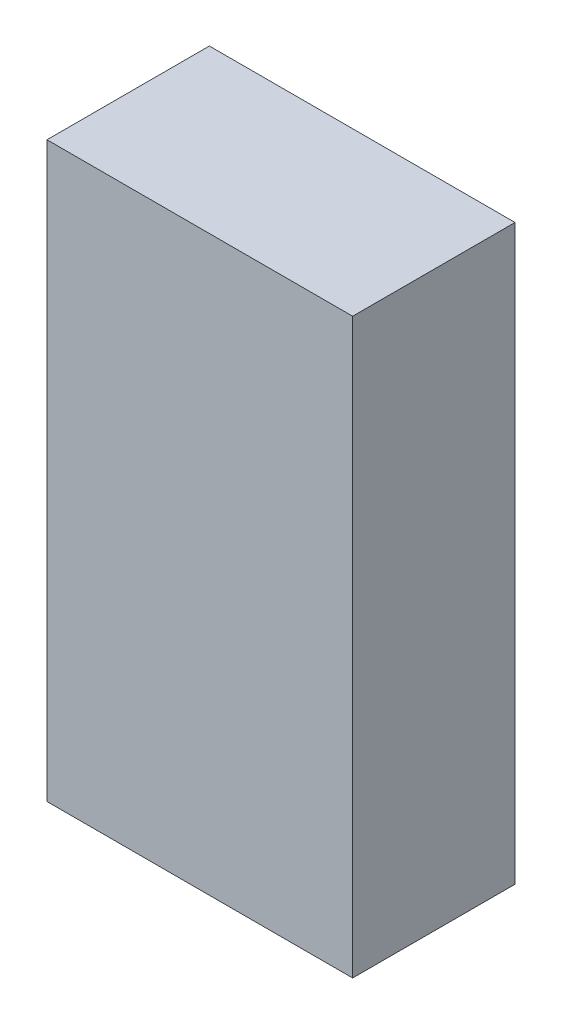
ISO-10303-21;
HEADER;
FILE_DESCRIPTION(('STEP AP214'),'2;1');
FILE_NAME('part.step','',(''),(''),'','','');
FILE_SCHEMA(('AUTOMOTIVE_DESIGN { 1 0 10303 214 1 1 1 1 }'));
ENDSEC;
DATA;
#1=APPLICATION_CONTEXT('core data for automotive mechanical design processes');
#2=APPLICATION_PROTOCOL_DEFINITION('international standard','automotive_design',2000,#1);
#3=PRODUCT_CONTEXT('',#1,'mechanical');
#4=PRODUCT('Part','Part','',(#3));
#5=PRODUCT_RELATED_PRODUCT_CATEGORY('part','',(#4));
#6=PRODUCT_DEFINITION_FORMATION('','',#4);
#7=PRODUCT_DEFINITION_CONTEXT('part definition',#1,'design');
#8=PRODUCT_DEFINITION('design','',#6,#7);
#9=PRODUCT_DEFINITION_SHAPE('','',#8);
#10=(LENGTH_UNIT() NAMED_UNIT(*) SI_UNIT(.MILLI.,.METRE.));
#11=(NAMED_UNIT(*) PLANE_ANGLE_UNIT() SI_UNIT($,.RADIAN.));
#12=(NAMED_UNIT(*) SI_UNIT($,.STERADIAN.) SOLID_ANGLE_UNIT());
#13=UNCERTAINTY_MEASURE_WITH_UNIT(LENGTH_MEASURE(1.E-05),#10,'distance_accuracy_value','');
#14=(GEOMETRIC_REPRESENTATION_CONTEXT(3) GLOBAL_UNCERTAINTY_ASSIGNED_CONTEXT((#13)) GLOBAL_UNIT_ASSIGNED_CONTEXT((#10,
#11,#12)) REPRESENTATION_CONTEXT('',''));
#15=CARTESIAN_POINT('',(0.,0.,0.));
#16=DIRECTION('',(0.,0.,1.));
#17=DIRECTION('',(1.,0.,0.));
#18=AXIS2_PLACEMENT_3D('',#15,#16,#17);
#19=CARTESIAN_POINT('',(0.3999992,0.75000104,0.42499788));
#20=DIRECTION('',(0.,0.,1.));
#21=DIRECTION('',(1.,0.,0.));
#22=AXIS2_PLACEMENT_3D('',#19,#20,#21);
#23=PLANE('',#22);
#24=DIRECTION('',(0.,-1.,0.));
#25=VECTOR('',#24,1.);
#26=CARTESIAN_POINT('',(0.3999992,0.75000104,0.42499788));
#27=LINE('',#26,#25);
#28=CARTESIAN_POINT('',(0.3999992,0.75000104,0.42499788));
#29=VERTEX_POINT('',#28);
#30=CARTESIAN_POINT('',(0.3999992,-0.75000104,0.42499788));
#31=VERTEX_POINT('',#30);
#32=EDGE_CURVE('E85',#29,#31,#27,.T.);
#33=ORIENTED_EDGE('',*,*,#32,.F.);
#34=DIRECTION('',(1.,0.,0.));
#35=VECTOR('',#34,1.);
#36=CARTESIAN_POINT('',(-0.3999992,0.75000104,0.42499788));
#37=LINE('',#36,#35);
#38=CARTESIAN_POINT('',(-0.3999992,0.75000104,0.42499788));
#39=VERTEX_POINT('',#38);
#40=EDGE_CURVE('E27',#39,#29,#37,.T.);
#41=ORIENTED_EDGE('',*,*,#40,.F.);
#42=DIRECTION('',(0.,1.,0.));
#43=VECTOR('',#42,1.);
#44=CARTESIAN_POINT('',(-0.3999992,-0.75000104,0.42499788));
#45=LINE('',#44,#43);
#46=CARTESIAN_POINT('',(-0.3999992,-0.75000104,0.42499788));
#47=VERTEX_POINT('',#46);
#48=EDGE_CURVE('E20',#47,#39,#45,.T.);
#49=ORIENTED_EDGE('',*,*,#48,.F.);
#50=DIRECTION('',(-1.,0.,0.));
#51=VECTOR('',#50,1.);
#52=CARTESIAN_POINT('',(0.3999992,-0.75000104,0.42499788));
#53=LINE('',#52,#51);
#54=EDGE_CURVE('E81',#31,#47,#53,.T.);
#55=ORIENTED_EDGE('',*,*,#54,.F.);
#56=EDGE_LOOP('',(#33,#41,#49,#55));
#57=FACE_BOUND('',#56,.T.);
#58=ADVANCED_FACE('F17',(#57),#23,.T.);
#59=CARTESIAN_POINT('',(0.3999992,0.75000104,0.));
#60=DIRECTION('',(0.,0.,1.));
#61=DIRECTION('',(1.,0.,0.));
#62=AXIS2_PLACEMENT_3D('',#59,#60,#61);
#63=PLANE('',#62);
#64=DIRECTION('',(0.,-1.,0.));
#65=VECTOR('',#64,1.);
#66=CARTESIAN_POINT('',(0.3999992,0.75000104,0.));
#67=LINE('',#66,#65);
#68=CARTESIAN_POINT('',(0.3999992,0.75000104,0.));
#69=VERTEX_POINT('',#68);
#70=CARTESIAN_POINT('',(0.3999992,-0.75000104,0.));
#71=VERTEX_POINT('',#70);
#72=EDGE_CURVE('E69',#69,#71,#67,.T.);
#73=ORIENTED_EDGE('',*,*,#72,.T.);
#74=DIRECTION('',(-1.,0.,0.));
#75=VECTOR('',#74,1.);
#76=CARTESIAN_POINT('',(0.3999992,-0.75000104,0.));
#77=LINE('',#76,#75);
#78=CARTESIAN_POINT('',(-0.3999992,-0.75000104,0.));
#79=VERTEX_POINT('',#78);
#80=EDGE_CURVE('E110',#71,#79,#77,.T.);
#81=ORIENTED_EDGE('',*,*,#80,.T.);
#82=DIRECTION('',(0.,1.,0.));
#83=VECTOR('',#82,1.);
#84=CARTESIAN_POINT('',(-0.3999992,-0.75000104,0.));
#85=LINE('',#84,#83);
#86=CARTESIAN_POINT('',(-0.3999992,0.75000104,0.));
#87=VERTEX_POINT('',#86);
#88=EDGE_CURVE('E71',#79,#87,#85,.T.);
#89=ORIENTED_EDGE('',*,*,#88,.T.);
#90=DIRECTION('',(1.,0.,0.));
#91=VECTOR('',#90,1.);
#92=CARTESIAN_POINT('',(-0.3999992,0.75000104,0.));
#93=LINE('',#92,#91);
#94=EDGE_CURVE('E11',#87,#69,#93,.T.);
#95=ORIENTED_EDGE('',*,*,#94,.T.);
#96=EDGE_LOOP('',(#73,#81,#89,#95));
#97=FACE_BOUND('',#96,.T.);
#98=ADVANCED_FACE('F67',(#97),#63,.F.);
#99=CARTESIAN_POINT('',(-0.3999992,0.75000104,0.));
#100=DIRECTION('',(0.,1.,0.));
#101=DIRECTION('',(1.,0.,0.));
#102=AXIS2_PLACEMENT_3D('',#99,#100,#101);
#103=PLANE('',#102);
#104=DIRECTION('',(0.,0.,1.));
#105=VECTOR('',#104,1.);
#106=CARTESIAN_POINT('',(-0.3999992,0.75000104,0.));
#107=LINE('',#106,#105);
#108=EDGE_CURVE('E96',#87,#39,#107,.T.);
#109=ORIENTED_EDGE('',*,*,#108,.T.);
#110=ORIENTED_EDGE('',*,*,#40,.T.);
#111=DIRECTION('',(0.,0.,1.));
#112=VECTOR('',#111,1.);
#113=CARTESIAN_POINT('',(0.3999992,0.75000104,0.));
#114=LINE('',#113,#112);
#115=EDGE_CURVE('E77',#69,#29,#114,.T.);
#116=ORIENTED_EDGE('',*,*,#115,.F.);
#117=ORIENTED_EDGE('',*,*,#94,.F.);
#118=EDGE_LOOP('',(#109,#110,#116,#117));
#119=FACE_BOUND('',#118,.T.);
#120=ADVANCED_FACE('F83',(#119),#103,.T.);
#121=CARTESIAN_POINT('',(-0.3999992,-0.75000104,0.));
#122=DIRECTION('',(-1.,0.,0.));
#123=DIRECTION('',(0.,0.,1.));
#124=AXIS2_PLACEMENT_3D('',#121,#122,#123);
#125=PLANE('',#124);
#126=DIRECTION('',(0.,0.,1.));
#127=VECTOR('',#126,1.);
#128=CARTESIAN_POINT('',(-0.3999992,-0.75000104,0.));
#129=LINE('',#128,#127);
#130=EDGE_CURVE('E103',#79,#47,#129,.T.);
#131=ORIENTED_EDGE('',*,*,#130,.T.);
#132=ORIENTED_EDGE('',*,*,#48,.T.);
#133=ORIENTED_EDGE('',*,*,#108,.F.);
#134=ORIENTED_EDGE('',*,*,#88,.F.);
#135=EDGE_LOOP('',(#131,#132,#133,#134));
#136=FACE_BOUND('',#135,.T.);
#137=ADVANCED_FACE('F117',(#136),#125,.T.);
#138=CARTESIAN_POINT('',(0.3999992,-0.75000104,0.));
#139=DIRECTION('',(0.,-1.,0.));
#140=DIRECTION('',(0.,0.,-1.));
#141=AXIS2_PLACEMENT_3D('',#138,#139,#140);
#142=PLANE('',#141);
#143=DIRECTION('',(0.,0.,1.));
#144=VECTOR('',#143,1.);
#145=CARTESIAN_POINT('',(0.3999992,-0.75000104,0.));
#146=LINE('',#145,#144);
#147=EDGE_CURVE('E79',#71,#31,#146,.T.);
#148=ORIENTED_EDGE('',*,*,#147,.T.);
#149=ORIENTED_EDGE('',*,*,#54,.T.);
#150=ORIENTED_EDGE('',*,*,#130,.F.);
#151=ORIENTED_EDGE('',*,*,#80,.F.);
#152=EDGE_LOOP('',(#148,#149,#150,#151));
#153=FACE_BOUND('',#152,.T.);
#154=ADVANCED_FACE('F108',(#153),#142,.T.);
#155=CARTESIAN_POINT('',(0.3999992,0.75000104,0.));
#156=DIRECTION('',(1.,0.,0.));
#157=DIRECTION('',(0.,1.,0.));
#158=AXIS2_PLACEMENT_3D('',#155,#156,#157);
#159=PLANE('',#158);
#160=ORIENTED_EDGE('',*,*,#115,.T.);
#161=ORIENTED_EDGE('',*,*,#32,.T.);
#162=ORIENTED_EDGE('',*,*,#147,.F.);
#163=ORIENTED_EDGE('',*,*,#72,.F.);
#164=EDGE_LOOP('',(#160,#161,#162,#163));
#165=FACE_BOUND('',#164,.T.);
#166=ADVANCED_FACE('F75',(#165),#159,.T.);
#167=CLOSED_SHELL('',(#58,#98,#120,#137,#154,#166));
#168=MANIFOLD_SOLID_BREP('B1',#167);
#169=ADVANCED_BREP_SHAPE_REPRESENTATION('',(#18,#168),#14);
#170=SHAPE_DEFINITION_REPRESENTATION(#9,#169);
ENDSEC;
END-ISO-10303-21;
